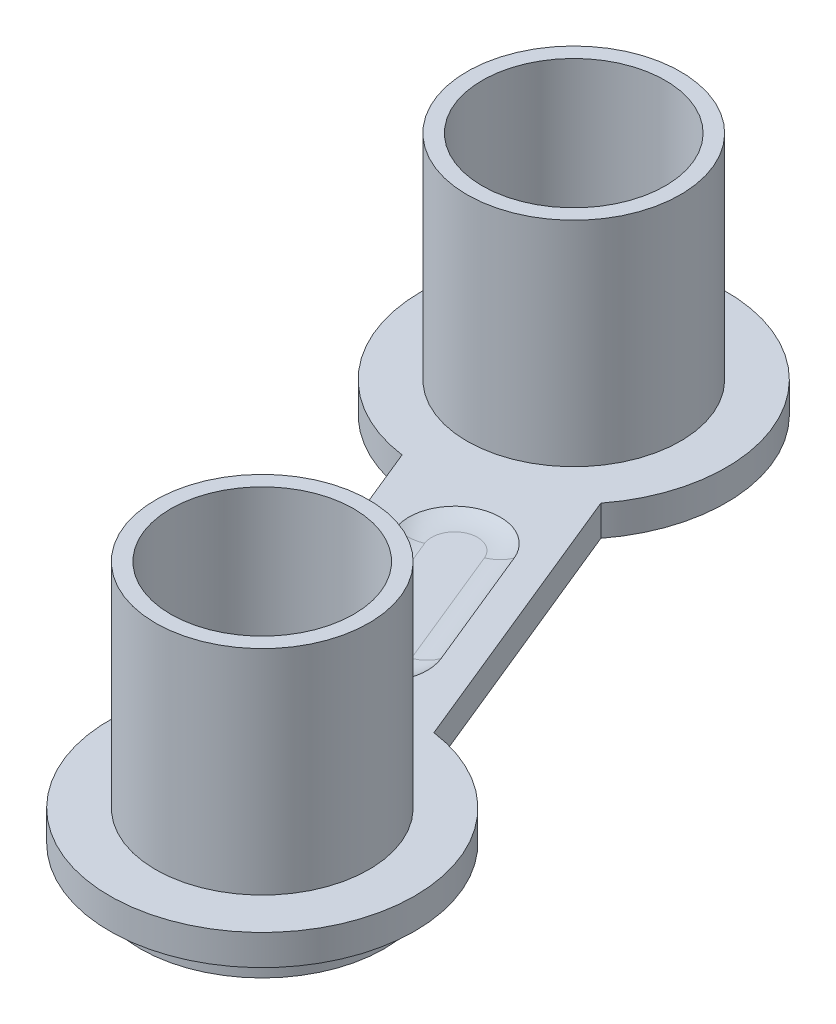
ISO-10303-21;
HEADER;
FILE_DESCRIPTION(('STEP AP214'),'2;1');
FILE_NAME('part.step','',(''),(''),'','','');
FILE_SCHEMA(('AUTOMOTIVE_DESIGN { 1 0 10303 214 1 1 1 1 }'));
ENDSEC;
DATA;
#1=APPLICATION_CONTEXT('core data for automotive mechanical design processes');
#2=APPLICATION_PROTOCOL_DEFINITION('international standard','automotive_design',2000,#1);
#3=PRODUCT_CONTEXT('',#1,'mechanical');
#4=PRODUCT('Part','Part','',(#3));
#5=PRODUCT_RELATED_PRODUCT_CATEGORY('part','',(#4));
#6=PRODUCT_DEFINITION_FORMATION('','',#4);
#7=PRODUCT_DEFINITION_CONTEXT('part definition',#1,'design');
#8=PRODUCT_DEFINITION('design','',#6,#7);
#9=PRODUCT_DEFINITION_SHAPE('','',#8);
#10=(LENGTH_UNIT() NAMED_UNIT(*) SI_UNIT(.MILLI.,.METRE.));
#11=(NAMED_UNIT(*) PLANE_ANGLE_UNIT() SI_UNIT($,.RADIAN.));
#12=(NAMED_UNIT(*) SI_UNIT($,.STERADIAN.) SOLID_ANGLE_UNIT());
#13=UNCERTAINTY_MEASURE_WITH_UNIT(LENGTH_MEASURE(1.E-05),#10,'distance_accuracy_value','');
#14=(GEOMETRIC_REPRESENTATION_CONTEXT(3) GLOBAL_UNCERTAINTY_ASSIGNED_CONTEXT((#13)) GLOBAL_UNIT_ASSIGNED_CONTEXT((#10,
#11,#12)) REPRESENTATION_CONTEXT('',''));
#15=CARTESIAN_POINT('',(0.,0.,0.));
#16=DIRECTION('',(0.,0.,1.));
#17=DIRECTION('',(1.,0.,0.));
#18=AXIS2_PLACEMENT_3D('',#15,#16,#17);
#19=CARTESIAN_POINT('',(0.,1.,0.));
#20=DIRECTION('',(0.,1.,0.));
#21=DIRECTION('',(0.,0.,1.));
#22=AXIS2_PLACEMENT_3D('',#19,#20,#21);
#23=PLANE('',#22);
#24=CARTESIAN_POINT('',(-50.9412423642104,1.,-0.850908902371951));
#25=DIRECTION('',(0.,1.,0.));
#26=DIRECTION('',(0.,0.,1.));
#27=AXIS2_PLACEMENT_3D('',#24,#25,#26);
#28=CIRCLE('',#27,3.5);
#29=CARTESIAN_POINT('',(-50.9412423642104,1.,2.64909109762805));
#30=VERTEX_POINT('',#29);
#31=EDGE_CURVE('E194',#30,#30,#28,.T.);
#32=ORIENTED_EDGE('',*,*,#31,.F.);
#33=EDGE_LOOP('',(#32));
#34=FACE_BOUND('',#33,.T.);
#35=CARTESIAN_POINT('',(-50.9412423642104,1.,-0.850908902371951));
#36=DIRECTION('',(0.,1.,0.));
#37=DIRECTION('',(0.,0.,1.));
#38=AXIS2_PLACEMENT_3D('',#35,#36,#37);
#39=CIRCLE('',#38,5.);
#40=CARTESIAN_POINT('',(-54.8933550108173,1.,-3.91371898929045));
#41=VERTEX_POINT('',#40);
#42=CARTESIAN_POINT('',(-50.2648273452752,1.,-5.80494389641054));
#43=VERTEX_POINT('',#42);
#44=EDGE_CURVE('E201',#41,#43,#39,.T.);
#45=ORIENTED_EDGE('',*,*,#44,.T.);
#46=DIRECTION('',(0.378244981424019,0.,0.92570553310842));
#47=VECTOR('',#46,1.);
#48=CARTESIAN_POINT('',(-41.0409121810859,1.,16.769392112666));
#49=LINE('',#48,#47);
#50=CARTESIAN_POINT('',(-54.0472771595154,1.,-15.0619992274947));
#51=VERTEX_POINT('',#50);
#52=EDGE_CURVE('E203',#51,#43,#49,.T.);
#53=ORIENTED_EDGE('',*,*,#52,.F.);
#54=CARTESIAN_POINT('',(-57.9993898061223,1.,-18.1248093144132));
#55=DIRECTION('',(0.,1.,0.));
#56=DIRECTION('',(0.,0.,1.));
#57=AXIS2_PLACEMENT_3D('',#54,#55,#56);
#58=CIRCLE('',#57,5.);
#59=CARTESIAN_POINT('',(-58.6758048250575,1.,-13.1707743203747));
#60=VERTEX_POINT('',#59);
#61=EDGE_CURVE('E207',#51,#60,#58,.T.);
#62=ORIENTED_EDGE('',*,*,#61,.T.);
#63=DIRECTION('',(0.378244981424018,0.,0.92570553310842));
#64=VECTOR('',#63,1.);
#65=CARTESIAN_POINT('',(-45.669439846628,1.,18.6606170197861));
#66=LINE('',#65,#64);
#67=EDGE_CURVE('E209',#60,#41,#66,.T.);
#68=ORIENTED_EDGE('',*,*,#67,.T.);
#69=EDGE_LOOP('',(#45,#53,#62,#68));
#70=FACE_BOUND('',#69,.T.);
#71=CARTESIAN_POINT('',(-57.9993898061223,1.,-18.1248093144132));
#72=DIRECTION('',(0.,1.,0.));
#73=DIRECTION('',(0.,0.,1.));
#74=AXIS2_PLACEMENT_3D('',#71,#72,#73);
#75=CIRCLE('',#74,3.5);
#76=CARTESIAN_POINT('',(-57.9993898061223,1.,-14.6248093144132));
#77=VERTEX_POINT('',#76);
#78=EDGE_CURVE('E185',#77,#77,#75,.T.);
#79=ORIENTED_EDGE('',*,*,#78,.F.);
#80=EDGE_LOOP('',(#79));
#81=FACE_BOUND('',#80,.T.);
#82=DIRECTION('',(0.378244981424018,0.,0.92570553310842));
#83=VECTOR('',#82,1.);
#84=CARTESIAN_POINT('',(-41.9666177141943,1.,17.14763709409));
#85=LINE('',#84,#83);
#86=CARTESIAN_POINT('',(-53.9101752904403,1.,-12.0826709768998));
#87=VERTEX_POINT('',#86);
#88=CARTESIAN_POINT('',(-52.2533402805671,1.,-8.02778218415741));
#89=VERTEX_POINT('',#88);
#90=EDGE_CURVE('E149',#87,#89,#85,.T.);
#91=ORIENTED_EDGE('',*,*,#90,.T.);
#92=CARTESIAN_POINT('',(-53.6418985802298,1.,-7.46041471202139));
#93=DIRECTION('',(0.,-1.,0.));
#94=DIRECTION('',(0.,0.,-1.));
#95=AXIS2_PLACEMENT_3D('',#92,#93,#94);
#96=CIRCLE('',#95,1.5);
#97=CARTESIAN_POINT('',(-55.0304568798924,1.,-6.89304723988535));
#98=VERTEX_POINT('',#97);
#99=EDGE_CURVE('E154',#89,#98,#96,.T.);
#100=ORIENTED_EDGE('',*,*,#99,.T.);
#101=DIRECTION('',(0.378244981424018,0.,0.92570553310842));
#102=VECTOR('',#101,1.);
#103=CARTESIAN_POINT('',(-44.7437343135196,1.,18.2823720383621));
#104=LINE('',#103,#102);
#105=CARTESIAN_POINT('',(-56.6872918897656,1.,-10.9479360326278));
#106=VERTEX_POINT('',#105);
#107=EDGE_CURVE('E157',#106,#98,#104,.T.);
#108=ORIENTED_EDGE('',*,*,#107,.F.);
#109=CARTESIAN_POINT('',(-55.2987335901029,1.,-11.5153035047638));
#110=DIRECTION('',(0.,-1.,0.));
#111=DIRECTION('',(0.,0.,-1.));
#112=AXIS2_PLACEMENT_3D('',#109,#110,#111);
#113=CIRCLE('',#112,1.5);
#114=EDGE_CURVE('E144',#106,#87,#113,.T.);
#115=ORIENTED_EDGE('',*,*,#114,.T.);
#116=EDGE_LOOP('',(#91,#100,#108,#115));
#117=FACE_BOUND('',#116,.T.);
#118=ADVANCED_FACE('F51',(#34,#70,#81,#117),#23,.T.);
#119=CARTESIAN_POINT('',(0.,0.,0.));
#120=DIRECTION('',(0.,1.,0.));
#121=DIRECTION('',(0.,0.,1.));
#122=AXIS2_PLACEMENT_3D('',#119,#120,#121);
#123=PLANE('',#122);
#124=DIRECTION('',(0.378244981424018,0.,0.92570553310842));
#125=VECTOR('',#124,1.);
#126=CARTESIAN_POINT('',(-44.7437343135196,0.,18.2823720383621));
#127=LINE('',#126,#125);
#128=CARTESIAN_POINT('',(-56.6872918897656,0.,-10.9479360326278));
#129=VERTEX_POINT('',#128);
#130=CARTESIAN_POINT('',(-55.0304568798924,0.,-6.89304723988534));
#131=VERTEX_POINT('',#130);
#132=EDGE_CURVE('E167',#129,#131,#127,.T.);
#133=ORIENTED_EDGE('',*,*,#132,.T.);
#134=CARTESIAN_POINT('',(-53.6418985802298,0.,-7.46041471202139));
#135=DIRECTION('',(0.,-1.,0.));
#136=DIRECTION('',(0.,0.,-1.));
#137=AXIS2_PLACEMENT_3D('',#134,#135,#136);
#138=CIRCLE('',#137,1.5);
#139=CARTESIAN_POINT('',(-52.2533402805672,0.,-8.02778218415741));
#140=VERTEX_POINT('',#139);
#141=EDGE_CURVE('E164',#140,#131,#138,.T.);
#142=ORIENTED_EDGE('',*,*,#141,.F.);
#143=DIRECTION('',(0.378244981424018,0.,0.92570553310842));
#144=VECTOR('',#143,1.);
#145=CARTESIAN_POINT('',(-41.9666177141943,0.,17.14763709409));
#146=LINE('',#145,#144);
#147=CARTESIAN_POINT('',(-53.9101752904403,0.,-12.0826709768998));
#148=VERTEX_POINT('',#147);
#149=EDGE_CURVE('E173',#148,#140,#146,.T.);
#150=ORIENTED_EDGE('',*,*,#149,.F.);
#151=CARTESIAN_POINT('',(-55.2987335901029,0.,-11.5153035047638));
#152=DIRECTION('',(0.,-1.,0.));
#153=DIRECTION('',(0.,0.,-1.));
#154=AXIS2_PLACEMENT_3D('',#151,#152,#153);
#155=CIRCLE('',#154,1.5);
#156=EDGE_CURVE('E170',#129,#148,#155,.T.);
#157=ORIENTED_EDGE('',*,*,#156,.F.);
#158=EDGE_LOOP('',(#133,#142,#150,#157));
#159=FACE_BOUND('',#158,.T.);
#160=CARTESIAN_POINT('',(-57.9993898061223,0.,-18.1248093144132));
#161=DIRECTION('',(0.,1.,0.));
#162=DIRECTION('',(0.,0.,1.));
#163=AXIS2_PLACEMENT_3D('',#160,#161,#162);
#164=CIRCLE('',#163,3.);
#165=CARTESIAN_POINT('',(-57.9993898061223,0.,-15.1248093144132));
#166=VERTEX_POINT('',#165);
#167=EDGE_CURVE('E204',#166,#166,#164,.T.);
#168=ORIENTED_EDGE('',*,*,#167,.T.);
#169=EDGE_LOOP('',(#168));
#170=FACE_BOUND('',#169,.T.);
#171=CARTESIAN_POINT('',(-50.9412423642104,0.,-0.850908902371951));
#172=DIRECTION('',(0.,1.,0.));
#173=DIRECTION('',(0.,0.,1.));
#174=AXIS2_PLACEMENT_3D('',#171,#172,#173);
#175=CIRCLE('',#174,5.);
#176=CARTESIAN_POINT('',(-54.8933550108173,0.,-3.91371898929045));
#177=VERTEX_POINT('',#176);
#178=CARTESIAN_POINT('',(-50.2648273452752,0.,-5.80494389641054));
#179=VERTEX_POINT('',#178);
#180=EDGE_CURVE('E198',#177,#179,#175,.T.);
#181=ORIENTED_EDGE('',*,*,#180,.F.);
#182=DIRECTION('',(0.378244981424018,0.,0.92570553310842));
#183=VECTOR('',#182,1.);
#184=CARTESIAN_POINT('',(-45.669439846628,0.,18.6606170197861));
#185=LINE('',#184,#183);
#186=CARTESIAN_POINT('',(-58.6758048250575,0.,-13.1707743203747));
#187=VERTEX_POINT('',#186);
#188=EDGE_CURVE('E219',#187,#177,#185,.T.);
#189=ORIENTED_EDGE('',*,*,#188,.F.);
#190=CARTESIAN_POINT('',(-57.9993898061223,0.,-18.1248093144132));
#191=DIRECTION('',(0.,1.,0.));
#192=DIRECTION('',(0.,0.,1.));
#193=AXIS2_PLACEMENT_3D('',#190,#191,#192);
#194=CIRCLE('',#193,5.);
#195=CARTESIAN_POINT('',(-54.0472771595154,0.,-15.0619992274947));
#196=VERTEX_POINT('',#195);
#197=EDGE_CURVE('E217',#196,#187,#194,.T.);
#198=ORIENTED_EDGE('',*,*,#197,.F.);
#199=DIRECTION('',(0.378244981424019,0.,0.92570553310842));
#200=VECTOR('',#199,1.);
#201=CARTESIAN_POINT('',(-41.0409121810859,0.,16.769392112666));
#202=LINE('',#201,#200);
#203=EDGE_CURVE('E214',#196,#179,#202,.T.);
#204=ORIENTED_EDGE('',*,*,#203,.T.);
#205=EDGE_LOOP('',(#181,#189,#198,#204));
#206=FACE_BOUND('',#205,.T.);
#207=CARTESIAN_POINT('',(-50.9412423642104,0.,-0.850908902371951));
#208=DIRECTION('',(0.,1.,0.));
#209=DIRECTION('',(0.,0.,1.));
#210=AXIS2_PLACEMENT_3D('',#207,#208,#209);
#211=CIRCLE('',#210,4.);
#212=CARTESIAN_POINT('',(-50.9412423642104,0.,3.14909109762805));
#213=VERTEX_POINT('',#212);
#214=EDGE_CURVE('E232',#213,#213,#211,.F.);
#215=ORIENTED_EDGE('',*,*,#214,.F.);
#216=EDGE_LOOP('',(#215));
#217=FACE_BOUND('',#216,.T.);
#218=ADVANCED_FACE('F275',(#159,#170,#206,#217),#123,.F.);
#219=CARTESIAN_POINT('',(-50.9412423642104,1.,-0.850908902371951));
#220=DIRECTION('',(0.,-1.,0.));
#221=DIRECTION('',(0.,0.,-1.));
#222=AXIS2_PLACEMENT_3D('',#219,#220,#221);
#223=CYLINDRICAL_SURFACE('',#222,5.);
#224=ORIENTED_EDGE('',*,*,#180,.T.);
#225=DIRECTION('',(0.,-1.,0.));
#226=VECTOR('',#225,1.);
#227=CARTESIAN_POINT('',(-50.2648273452752,1.,-5.80494389641054));
#228=LINE('',#227,#226);
#229=EDGE_CURVE('E230',#43,#179,#228,.T.);
#230=ORIENTED_EDGE('',*,*,#229,.F.);
#231=ORIENTED_EDGE('',*,*,#44,.F.);
#232=DIRECTION('',(0.,-1.,0.));
#233=VECTOR('',#232,1.);
#234=CARTESIAN_POINT('',(-54.8933550108173,1.,-3.91371898929045));
#235=LINE('',#234,#233);
#236=EDGE_CURVE('E211',#41,#177,#235,.T.);
#237=ORIENTED_EDGE('',*,*,#236,.T.);
#238=EDGE_LOOP('',(#224,#230,#231,#237));
#239=FACE_BOUND('',#238,.T.);
#240=ADVANCED_FACE('F281',(#239),#223,.T.);
#241=CARTESIAN_POINT('',(-41.0409121810859,1.,16.769392112666));
#242=DIRECTION('',(0.92570553310842,0.,-0.378244981424019));
#243=DIRECTION('',(-0.378244981424019,0.,-0.92570553310842));
#244=AXIS2_PLACEMENT_3D('',#241,#242,#243);
#245=PLANE('',#244);
#246=ORIENTED_EDGE('',*,*,#203,.F.);
#247=DIRECTION('',(0.,-1.,0.));
#248=VECTOR('',#247,1.);
#249=CARTESIAN_POINT('',(-54.0472771595154,1.,-15.0619992274947));
#250=LINE('',#249,#248);
#251=EDGE_CURVE('E228',#51,#196,#250,.T.);
#252=ORIENTED_EDGE('',*,*,#251,.F.);
#253=ORIENTED_EDGE('',*,*,#52,.T.);
#254=ORIENTED_EDGE('',*,*,#229,.T.);
#255=EDGE_LOOP('',(#246,#252,#253,#254));
#256=FACE_BOUND('',#255,.T.);
#257=ADVANCED_FACE('F303',(#256),#245,.T.);
#258=CARTESIAN_POINT('',(-57.9993898061223,1.,-18.1248093144132));
#259=DIRECTION('',(0.,-1.,0.));
#260=DIRECTION('',(0.,0.,-1.));
#261=AXIS2_PLACEMENT_3D('',#258,#259,#260);
#262=CYLINDRICAL_SURFACE('',#261,5.);
#263=ORIENTED_EDGE('',*,*,#197,.T.);
#264=DIRECTION('',(0.,-1.,0.));
#265=VECTOR('',#264,1.);
#266=CARTESIAN_POINT('',(-58.6758048250575,1.,-13.1707743203747));
#267=LINE('',#266,#265);
#268=EDGE_CURVE('E225',#60,#187,#267,.T.);
#269=ORIENTED_EDGE('',*,*,#268,.F.);
#270=ORIENTED_EDGE('',*,*,#61,.F.);
#271=ORIENTED_EDGE('',*,*,#251,.T.);
#272=EDGE_LOOP('',(#263,#269,#270,#271));
#273=FACE_BOUND('',#272,.T.);
#274=ADVANCED_FACE('F299',(#273),#262,.T.);
#275=CARTESIAN_POINT('',(-45.669439846628,1.,18.6606170197861));
#276=DIRECTION('',(0.92570553310842,0.,-0.378244981424018));
#277=DIRECTION('',(-0.378244981424018,0.,-0.92570553310842));
#278=AXIS2_PLACEMENT_3D('',#275,#276,#277);
#279=PLANE('',#278);
#280=ORIENTED_EDGE('',*,*,#188,.T.);
#281=ORIENTED_EDGE('',*,*,#236,.F.);
#282=ORIENTED_EDGE('',*,*,#67,.F.);
#283=ORIENTED_EDGE('',*,*,#268,.T.);
#284=EDGE_LOOP('',(#280,#281,#282,#283));
#285=FACE_BOUND('',#284,.T.);
#286=ADVANCED_FACE('F296',(#285),#279,.F.);
#287=CARTESIAN_POINT('',(-50.9412423642104,1.,-0.850908902371951));
#288=DIRECTION('',(0.,-1.,0.));
#289=DIRECTION('',(0.,0.,-1.));
#290=AXIS2_PLACEMENT_3D('',#287,#288,#289);
#291=CYLINDRICAL_SURFACE('',#290,3.);
#292=CARTESIAN_POINT('',(-50.9412423642104,8.,-0.850908902371951));
#293=DIRECTION('',(0.,1.,0.));
#294=DIRECTION('',(0.,0.,1.));
#295=AXIS2_PLACEMENT_3D('',#292,#293,#294);
#296=CIRCLE('',#295,3.);
#297=CARTESIAN_POINT('',(-50.9412423642104,8.,2.14909109762805));
#298=VERTEX_POINT('',#297);
#299=EDGE_CURVE('E189',#298,#298,#296,.T.);
#300=ORIENTED_EDGE('',*,*,#299,.T.);
#301=EDGE_LOOP('',(#300));
#302=FACE_BOUND('',#301,.T.);
#303=CARTESIAN_POINT('',(-50.9412423642104,-1.,-0.850908902371951));
#304=DIRECTION('',(0.,-1.,0.));
#305=DIRECTION('',(0.,0.,-1.));
#306=AXIS2_PLACEMENT_3D('',#303,#304,#305);
#307=CIRCLE('',#306,3.);
#308=CARTESIAN_POINT('',(-50.9412423642104,-1.,-3.85090890237195));
#309=VERTEX_POINT('',#308);
#310=EDGE_CURVE('E176',#309,#309,#307,.T.);
#311=ORIENTED_EDGE('',*,*,#310,.T.);
#312=EDGE_LOOP('',(#311));
#313=FACE_BOUND('',#312,.T.);
#314=ADVANCED_FACE('F294',(#302,#313),#291,.F.);
#315=CARTESIAN_POINT('',(-57.9993898061223,1.,-18.1248093144132));
#316=DIRECTION('',(0.,-1.,0.));
#317=DIRECTION('',(0.,0.,-1.));
#318=AXIS2_PLACEMENT_3D('',#315,#316,#317);
#319=CYLINDRICAL_SURFACE('',#318,3.);
#320=ORIENTED_EDGE('',*,*,#167,.F.);
#321=EDGE_LOOP('',(#320));
#322=FACE_BOUND('',#321,.T.);
#323=CARTESIAN_POINT('',(-57.9993898061223,8.,-18.1248093144132));
#324=DIRECTION('',(0.,1.,0.));
#325=DIRECTION('',(0.,0.,1.));
#326=AXIS2_PLACEMENT_3D('',#323,#324,#325);
#327=CIRCLE('',#326,3.);
#328=CARTESIAN_POINT('',(-57.9993898061223,8.,-15.1248093144132));
#329=VERTEX_POINT('',#328);
#330=EDGE_CURVE('E182',#329,#329,#327,.T.);
#331=ORIENTED_EDGE('',*,*,#330,.T.);
#332=EDGE_LOOP('',(#331));
#333=FACE_BOUND('',#332,.T.);
#334=ADVANCED_FACE('F290',(#322,#333),#319,.F.);
#335=CARTESIAN_POINT('',(-50.9412423642104,8.,-0.850908902371951));
#336=DIRECTION('',(0.,1.,0.));
#337=DIRECTION('',(0.,0.,1.));
#338=AXIS2_PLACEMENT_3D('',#335,#336,#337);
#339=PLANE('',#338);
#340=CARTESIAN_POINT('',(-50.9412423642104,8.,-0.850908902371951));
#341=DIRECTION('',(0.,1.,0.));
#342=DIRECTION('',(0.,0.,1.));
#343=AXIS2_PLACEMENT_3D('',#340,#341,#342);
#344=CIRCLE('',#343,3.5);
#345=CARTESIAN_POINT('',(-50.9412423642104,8.,2.64909109762805));
#346=VERTEX_POINT('',#345);
#347=EDGE_CURVE('E195',#346,#346,#344,.T.);
#348=ORIENTED_EDGE('',*,*,#347,.T.);
#349=EDGE_LOOP('',(#348));
#350=FACE_BOUND('',#349,.T.);
#351=ORIENTED_EDGE('',*,*,#299,.F.);
#352=EDGE_LOOP('',(#351));
#353=FACE_BOUND('',#352,.T.);
#354=ADVANCED_FACE('F293',(#350,#353),#339,.T.);
#355=CARTESIAN_POINT('',(-50.9412423642104,8.,-0.850908902371951));
#356=DIRECTION('',(0.,-1.,0.));
#357=DIRECTION('',(0.,0.,-1.));
#358=AXIS2_PLACEMENT_3D('',#355,#356,#357);
#359=CYLINDRICAL_SURFACE('',#358,3.5);
#360=ORIENTED_EDGE('',*,*,#347,.F.);
#361=EDGE_LOOP('',(#360));
#362=FACE_BOUND('',#361,.T.);
#363=ORIENTED_EDGE('',*,*,#31,.T.);
#364=EDGE_LOOP('',(#363));
#365=FACE_BOUND('',#364,.T.);
#366=ADVANCED_FACE('F287',(#362,#365),#359,.T.);
#367=CARTESIAN_POINT('',(-57.9993898061223,8.,-18.1248093144132));
#368=DIRECTION('',(0.,1.,0.));
#369=DIRECTION('',(0.,0.,1.));
#370=AXIS2_PLACEMENT_3D('',#367,#368,#369);
#371=PLANE('',#370);
#372=CARTESIAN_POINT('',(-57.9993898061223,8.,-18.1248093144132));
#373=DIRECTION('',(0.,1.,0.));
#374=DIRECTION('',(0.,0.,1.));
#375=AXIS2_PLACEMENT_3D('',#372,#373,#374);
#376=CIRCLE('',#375,3.5);
#377=CARTESIAN_POINT('',(-57.9993898061223,8.,-14.6248093144132));
#378=VERTEX_POINT('',#377);
#379=EDGE_CURVE('E186',#378,#378,#376,.T.);
#380=ORIENTED_EDGE('',*,*,#379,.T.);
#381=EDGE_LOOP('',(#380));
#382=FACE_BOUND('',#381,.T.);
#383=ORIENTED_EDGE('',*,*,#330,.F.);
#384=EDGE_LOOP('',(#383));
#385=FACE_BOUND('',#384,.T.);
#386=ADVANCED_FACE('F442',(#382,#385),#371,.T.);
#387=CARTESIAN_POINT('',(-57.9993898061223,8.,-18.1248093144132));
#388=DIRECTION('',(0.,-1.,0.));
#389=DIRECTION('',(0.,0.,-1.));
#390=AXIS2_PLACEMENT_3D('',#387,#388,#389);
#391=CYLINDRICAL_SURFACE('',#390,3.5);
#392=ORIENTED_EDGE('',*,*,#379,.F.);
#393=EDGE_LOOP('',(#392));
#394=FACE_BOUND('',#393,.T.);
#395=ORIENTED_EDGE('',*,*,#78,.T.);
#396=EDGE_LOOP('',(#395));
#397=FACE_BOUND('',#396,.T.);
#398=ADVANCED_FACE('F426',(#394,#397),#391,.T.);
#399=CARTESIAN_POINT('',(-50.9412423642104,-1.,-0.850908902371951));
#400=DIRECTION('',(0.,-1.,0.));
#401=DIRECTION('',(0.,0.,-1.));
#402=AXIS2_PLACEMENT_3D('',#399,#400,#401);
#403=PLANE('',#402);
#404=CARTESIAN_POINT('',(-50.9412423642104,-1.,-0.850908902371951));
#405=DIRECTION('',(0.,-1.,0.));
#406=DIRECTION('',(0.,0.,-1.));
#407=AXIS2_PLACEMENT_3D('',#404,#405,#406);
#408=CIRCLE('',#407,4.);
#409=CARTESIAN_POINT('',(-50.9412423642104,-1.,-4.85090890237195));
#410=VERTEX_POINT('',#409);
#411=EDGE_CURVE('E179',#410,#410,#408,.T.);
#412=ORIENTED_EDGE('',*,*,#411,.T.);
#413=EDGE_LOOP('',(#412));
#414=FACE_BOUND('',#413,.T.);
#415=ORIENTED_EDGE('',*,*,#310,.F.);
#416=EDGE_LOOP('',(#415));
#417=FACE_BOUND('',#416,.T.);
#418=ADVANCED_FACE('F415',(#414,#417),#403,.T.);
#419=CARTESIAN_POINT('',(-50.9412423642104,-1.,-0.850908902371951));
#420=DIRECTION('',(0.,1.,0.));
#421=DIRECTION('',(0.,0.,1.));
#422=AXIS2_PLACEMENT_3D('',#419,#420,#421);
#423=CYLINDRICAL_SURFACE('',#422,4.);
#424=ORIENTED_EDGE('',*,*,#411,.F.);
#425=EDGE_LOOP('',(#424));
#426=FACE_BOUND('',#425,.T.);
#427=ORIENTED_EDGE('',*,*,#214,.T.);
#428=EDGE_LOOP('',(#427));
#429=FACE_BOUND('',#428,.T.);
#430=ADVANCED_FACE('F397',(#426,#429),#423,.T.);
#431=CARTESIAN_POINT('',(0.,0.2,0.));
#432=DIRECTION('',(0.,-1.,0.));
#433=DIRECTION('',(0.,0.,-1.));
#434=AXIS2_PLACEMENT_3D('',#431,#432,#433);
#435=PLANE('',#434);
#436=DIRECTION('',(-0.378244981424018,0.,-0.92570553310842));
#437=VECTOR('',#436,1.);
#438=CARTESIAN_POINT('',(-55.994557300579,0.2,-11.2309886583788));
#439=LINE('',#438,#437);
#440=CARTESIAN_POINT('',(-54.3377222907059,0.2,-7.17609986563642));
#441=VERTEX_POINT('',#440);
#442=CARTESIAN_POINT('',(-55.994557300579,0.2,-11.2309886583788));
#443=VERTEX_POINT('',#442);
#444=EDGE_CURVE('E235',#441,#443,#439,.T.);
#445=ORIENTED_EDGE('',*,*,#444,.T.);
#446=CARTESIAN_POINT('',(-55.2987335901029,0.2,-11.5153035047638));
#447=DIRECTION('',(0.,-1.,0.));
#448=DIRECTION('',(0.,0.,-1.));
#449=AXIS2_PLACEMENT_3D('',#446,#447,#448);
#450=CIRCLE('',#449,0.751668522645215);
#451=CARTESIAN_POINT('',(-54.6029098796268,0.2,-11.7996183511488));
#452=VERTEX_POINT('',#451);
#453=EDGE_CURVE('E241',#443,#452,#450,.T.);
#454=ORIENTED_EDGE('',*,*,#453,.T.);
#455=DIRECTION('',(-0.378244981424018,0.,-0.92570553310842));
#456=VECTOR('',#455,1.);
#457=CARTESIAN_POINT('',(-52.9460748697537,0.2,-7.74472955840633));
#458=LINE('',#457,#456);
#459=CARTESIAN_POINT('',(-52.9460748697537,0.2,-7.74472955840634));
#460=VERTEX_POINT('',#459);
#461=EDGE_CURVE('E239',#452,#460,#458,.F.);
#462=ORIENTED_EDGE('',*,*,#461,.T.);
#463=CARTESIAN_POINT('',(-53.6418985802298,0.2,-7.46041471202139));
#464=DIRECTION('',(0.,-1.,0.));
#465=DIRECTION('',(0.,0.,-1.));
#466=AXIS2_PLACEMENT_3D('',#463,#464,#465);
#467=CIRCLE('',#466,0.751668522645215);
#468=EDGE_CURVE('E237',#460,#441,#467,.T.);
#469=ORIENTED_EDGE('',*,*,#468,.T.);
#470=EDGE_LOOP('',(#445,#454,#462,#469));
#471=FACE_BOUND('',#470,.T.);
#472=ADVANCED_FACE('F324',(#471),#435,.T.);
#473=CARTESIAN_POINT('',(-53.6418985802298,-1.3,-7.46041471202139));
#474=DIRECTION('',(0.,1.,0.));
#475=DIRECTION('',(0.,0.,1.));
#476=AXIS2_PLACEMENT_3D('',#473,#474,#475);
#477=DEGENERATE_TOROIDAL_SURFACE('',#476,0.751668522645215,1.5,.T.);
#478=CARTESIAN_POINT('',(-52.9460748697537,-1.3,-7.74472955840634));
#479=DIRECTION('',(0.378244981424014,0.,0.925705533108422));
#480=DIRECTION('',(0.925705533108422,0.,-0.378244981424014));
#481=AXIS2_PLACEMENT_3D('',#478,#479,#480);
#482=CIRCLE('',#481,1.5);
#483=EDGE_CURVE('E248',#140,#460,#482,.T.);
#484=ORIENTED_EDGE('',*,*,#483,.F.);
#485=ORIENTED_EDGE('',*,*,#141,.T.);
#486=CARTESIAN_POINT('',(-54.3377222907059,-1.3,-7.17609986563642));
#487=DIRECTION('',(0.378244981424032,0.,0.925705533108414));
#488=DIRECTION('',(0.925705533108415,0.,-0.378244981424032));
#489=AXIS2_PLACEMENT_3D('',#486,#487,#488);
#490=CIRCLE('',#489,1.5);
#491=EDGE_CURVE('E168',#441,#131,#490,.T.);
#492=ORIENTED_EDGE('',*,*,#491,.F.);
#493=ORIENTED_EDGE('',*,*,#468,.F.);
#494=EDGE_LOOP('',(#484,#485,#492,#493));
#495=FACE_BOUND('',#494,.T.);
#496=ADVANCED_FACE('F320',(#495),#477,.F.);
#497=CARTESIAN_POINT('',(-44.0509997243331,-1.3,17.999319412611));
#498=DIRECTION('',(0.378244981424018,0.,0.92570553310842));
#499=DIRECTION('',(0.92570553310842,0.,-0.378244981424018));
#500=AXIS2_PLACEMENT_3D('',#497,#498,#499);
#501=CYLINDRICAL_SURFACE('',#500,1.5);
#502=ORIENTED_EDGE('',*,*,#491,.T.);
#503=ORIENTED_EDGE('',*,*,#132,.F.);
#504=CARTESIAN_POINT('',(-55.994557300579,-1.3,-11.2309886583788));
#505=DIRECTION('',(0.378244981424018,0.,0.92570553310842));
#506=DIRECTION('',(0.92570553310842,0.,-0.378244981424018));
#507=AXIS2_PLACEMENT_3D('',#504,#505,#506);
#508=CIRCLE('',#507,1.5);
#509=EDGE_CURVE('E246',#443,#129,#508,.T.);
#510=ORIENTED_EDGE('',*,*,#509,.F.);
#511=ORIENTED_EDGE('',*,*,#444,.F.);
#512=EDGE_LOOP('',(#502,#503,#510,#511));
#513=FACE_BOUND('',#512,.T.);
#514=ADVANCED_FACE('F316',(#513),#501,.F.);
#515=CARTESIAN_POINT('',(-42.6593523033808,-1.3,17.4306897198411));
#516=DIRECTION('',(0.378244981424018,0.,0.92570553310842));
#517=DIRECTION('',(0.92570553310842,0.,-0.378244981424018));
#518=AXIS2_PLACEMENT_3D('',#515,#516,#517);
#519=CYLINDRICAL_SURFACE('',#518,1.5);
#520=ORIENTED_EDGE('',*,*,#483,.T.);
#521=ORIENTED_EDGE('',*,*,#461,.F.);
#522=CARTESIAN_POINT('',(-54.6029098796268,-1.3,-11.7996183511488));
#523=DIRECTION('',(0.378244981424018,0.,0.92570553310842));
#524=DIRECTION('',(0.92570553310842,0.,-0.378244981424018));
#525=AXIS2_PLACEMENT_3D('',#522,#523,#524);
#526=CIRCLE('',#525,1.5);
#527=EDGE_CURVE('E160',#148,#452,#526,.T.);
#528=ORIENTED_EDGE('',*,*,#527,.F.);
#529=ORIENTED_EDGE('',*,*,#149,.T.);
#530=EDGE_LOOP('',(#520,#521,#528,#529));
#531=FACE_BOUND('',#530,.T.);
#532=ADVANCED_FACE('F270',(#531),#519,.F.);
#533=CARTESIAN_POINT('',(-55.2987335901029,-1.3,-11.5153035047638));
#534=DIRECTION('',(0.,1.,0.));
#535=DIRECTION('',(0.,0.,1.));
#536=AXIS2_PLACEMENT_3D('',#533,#534,#535);
#537=DEGENERATE_TOROIDAL_SURFACE('',#536,0.751668522645215,1.5,.T.);
#538=ORIENTED_EDGE('',*,*,#509,.T.);
#539=ORIENTED_EDGE('',*,*,#156,.T.);
#540=ORIENTED_EDGE('',*,*,#527,.T.);
#541=ORIENTED_EDGE('',*,*,#453,.F.);
#542=EDGE_LOOP('',(#538,#539,#540,#541));
#543=FACE_BOUND('',#542,.T.);
#544=ADVANCED_FACE('F264',(#543),#537,.F.);
#545=CARTESIAN_POINT('',(0.,0.8,0.));
#546=DIRECTION('',(0.,1.,0.));
#547=DIRECTION('',(0.,0.,-1.));
#548=AXIS2_PLACEMENT_3D('',#545,#546,#547);
#549=PLANE('',#548);
#550=DIRECTION('',(0.378244981424018,0.,0.92570553310842));
#551=VECTOR('',#550,1.);
#552=CARTESIAN_POINT('',(-54.6029098796268,0.8,-11.7996183511488));
#553=LINE('',#552,#551);
#554=CARTESIAN_POINT('',(-52.9460748697537,0.8,-7.74472955840634));
#555=VERTEX_POINT('',#554);
#556=CARTESIAN_POINT('',(-54.6029098796268,0.8,-11.7996183511488));
#557=VERTEX_POINT('',#556);
#558=EDGE_CURVE('E60',#555,#557,#553,.F.);
#559=ORIENTED_EDGE('',*,*,#558,.T.);
#560=CARTESIAN_POINT('',(-55.2987335901029,0.8,-11.5153035047638));
#561=DIRECTION('',(0.,1.,0.));
#562=DIRECTION('',(0.,0.,1.));
#563=AXIS2_PLACEMENT_3D('',#560,#561,#562);
#564=CIRCLE('',#563,0.751668522645215);
#565=CARTESIAN_POINT('',(-55.994557300579,0.8,-11.2309886583788));
#566=VERTEX_POINT('',#565);
#567=EDGE_CURVE('E13',#557,#566,#564,.T.);
#568=ORIENTED_EDGE('',*,*,#567,.T.);
#569=DIRECTION('',(0.378244981424018,0.,0.92570553310842));
#570=VECTOR('',#569,1.);
#571=CARTESIAN_POINT('',(-54.3377222907059,0.8,-7.17609986563642));
#572=LINE('',#571,#570);
#573=CARTESIAN_POINT('',(-54.3377222907059,0.8,-7.17609986563642));
#574=VERTEX_POINT('',#573);
#575=EDGE_CURVE('E244',#566,#574,#572,.T.);
#576=ORIENTED_EDGE('',*,*,#575,.T.);
#577=CARTESIAN_POINT('',(-53.6418985802298,0.8,-7.46041471202139));
#578=DIRECTION('',(0.,1.,0.));
#579=DIRECTION('',(0.,0.,1.));
#580=AXIS2_PLACEMENT_3D('',#577,#578,#579);
#581=CIRCLE('',#580,0.751668522645215);
#582=EDGE_CURVE('E71',#574,#555,#581,.T.);
#583=ORIENTED_EDGE('',*,*,#582,.T.);
#584=EDGE_LOOP('',(#559,#568,#576,#583));
#585=FACE_BOUND('',#584,.T.);
#586=ADVANCED_FACE('F262',(#585),#549,.T.);
#587=CARTESIAN_POINT('',(-53.6418985802298,2.3,-7.46041471202139));
#588=DIRECTION('',(0.,-1.,0.));
#589=DIRECTION('',(0.,0.,-1.));
#590=AXIS2_PLACEMENT_3D('',#587,#588,#589);
#591=DEGENERATE_TOROIDAL_SURFACE('',#590,0.751668522645215,1.5,.T.);
#592=CARTESIAN_POINT('',(-52.9460748697537,2.3,-7.74472955840634));
#593=DIRECTION('',(0.378244981424012,0.,0.925705533108422));
#594=DIRECTION('',(0.925705533108423,0.,-0.378244981424012));
#595=AXIS2_PLACEMENT_3D('',#592,#593,#594);
#596=CIRCLE('',#595,1.5);
#597=EDGE_CURVE('E151',#555,#89,#596,.T.);
#598=ORIENTED_EDGE('',*,*,#597,.F.);
#599=ORIENTED_EDGE('',*,*,#582,.F.);
#600=CARTESIAN_POINT('',(-54.3377222907059,2.3,-7.17609986563642));
#601=DIRECTION('',(0.378244981424022,0.,0.925705533108418));
#602=DIRECTION('',(0.925705533108419,0.,-0.378244981424022));
#603=AXIS2_PLACEMENT_3D('',#600,#601,#602);
#604=CIRCLE('',#603,1.5);
#605=EDGE_CURVE('E55',#98,#574,#604,.T.);
#606=ORIENTED_EDGE('',*,*,#605,.F.);
#607=ORIENTED_EDGE('',*,*,#99,.F.);
#608=EDGE_LOOP('',(#598,#599,#606,#607));
#609=FACE_BOUND('',#608,.T.);
#610=ADVANCED_FACE('F53',(#609),#591,.F.);
#611=CARTESIAN_POINT('',(-44.0509997243331,2.3,17.999319412611));
#612=DIRECTION('',(-0.378244981424018,0.,-0.92570553310842));
#613=DIRECTION('',(-0.92570553310842,0.,0.378244981424018));
#614=AXIS2_PLACEMENT_3D('',#611,#612,#613);
#615=CYLINDRICAL_SURFACE('',#614,1.5);
#616=ORIENTED_EDGE('',*,*,#605,.T.);
#617=ORIENTED_EDGE('',*,*,#575,.F.);
#618=CARTESIAN_POINT('',(-55.994557300579,2.3,-11.2309886583788));
#619=DIRECTION('',(0.378244981424018,0.,0.92570553310842));
#620=DIRECTION('',(0.92570553310842,0.,-0.378244981424018));
#621=AXIS2_PLACEMENT_3D('',#618,#619,#620);
#622=CIRCLE('',#621,1.5);
#623=EDGE_CURVE('E146',#106,#566,#622,.T.);
#624=ORIENTED_EDGE('',*,*,#623,.F.);
#625=ORIENTED_EDGE('',*,*,#107,.T.);
#626=EDGE_LOOP('',(#616,#617,#624,#625));
#627=FACE_BOUND('',#626,.T.);
#628=ADVANCED_FACE('F261',(#627),#615,.F.);
#629=CARTESIAN_POINT('',(-42.6593523033808,2.3,17.4306897198411));
#630=DIRECTION('',(-0.378244981424018,0.,-0.92570553310842));
#631=DIRECTION('',(-0.92570553310842,0.,0.378244981424018));
#632=AXIS2_PLACEMENT_3D('',#629,#630,#631);
#633=CYLINDRICAL_SURFACE('',#632,1.5);
#634=ORIENTED_EDGE('',*,*,#597,.T.);
#635=ORIENTED_EDGE('',*,*,#90,.F.);
#636=CARTESIAN_POINT('',(-54.6029098796268,2.3,-11.7996183511488));
#637=DIRECTION('',(0.378244981424017,0.,0.925705533108421));
#638=DIRECTION('',(0.925705533108421,0.,-0.378244981424017));
#639=AXIS2_PLACEMENT_3D('',#636,#637,#638);
#640=CIRCLE('',#639,1.5);
#641=EDGE_CURVE('E140',#557,#87,#640,.T.);
#642=ORIENTED_EDGE('',*,*,#641,.F.);
#643=ORIENTED_EDGE('',*,*,#558,.F.);
#644=EDGE_LOOP('',(#634,#635,#642,#643));
#645=FACE_BOUND('',#644,.T.);
#646=ADVANCED_FACE('F150',(#645),#633,.F.);
#647=CARTESIAN_POINT('',(-55.2987335901029,2.3,-11.5153035047638));
#648=DIRECTION('',(0.,-1.,0.));
#649=DIRECTION('',(0.,0.,-1.));
#650=AXIS2_PLACEMENT_3D('',#647,#648,#649);
#651=DEGENERATE_TOROIDAL_SURFACE('',#650,0.751668522645215,1.5,.T.);
#652=ORIENTED_EDGE('',*,*,#623,.T.);
#653=ORIENTED_EDGE('',*,*,#567,.F.);
#654=ORIENTED_EDGE('',*,*,#641,.T.);
#655=ORIENTED_EDGE('',*,*,#114,.F.);
#656=EDGE_LOOP('',(#652,#653,#654,#655));
#657=FACE_BOUND('',#656,.T.);
#658=ADVANCED_FACE('F142',(#657),#651,.F.);
#659=CLOSED_SHELL('',(#118,#218,#240,#257,#274,#286,#314,#334,#354,#366,#386,#398,#418,#430,
#472,#496,#514,#532,#544,#586,#610,#628,#646,#658));
#660=MANIFOLD_SOLID_BREP('B2',#659);
#661=ADVANCED_BREP_SHAPE_REPRESENTATION('',(#18,#660),#14);
#662=SHAPE_DEFINITION_REPRESENTATION(#9,#661);
ENDSEC;
END-ISO-10303-21;
